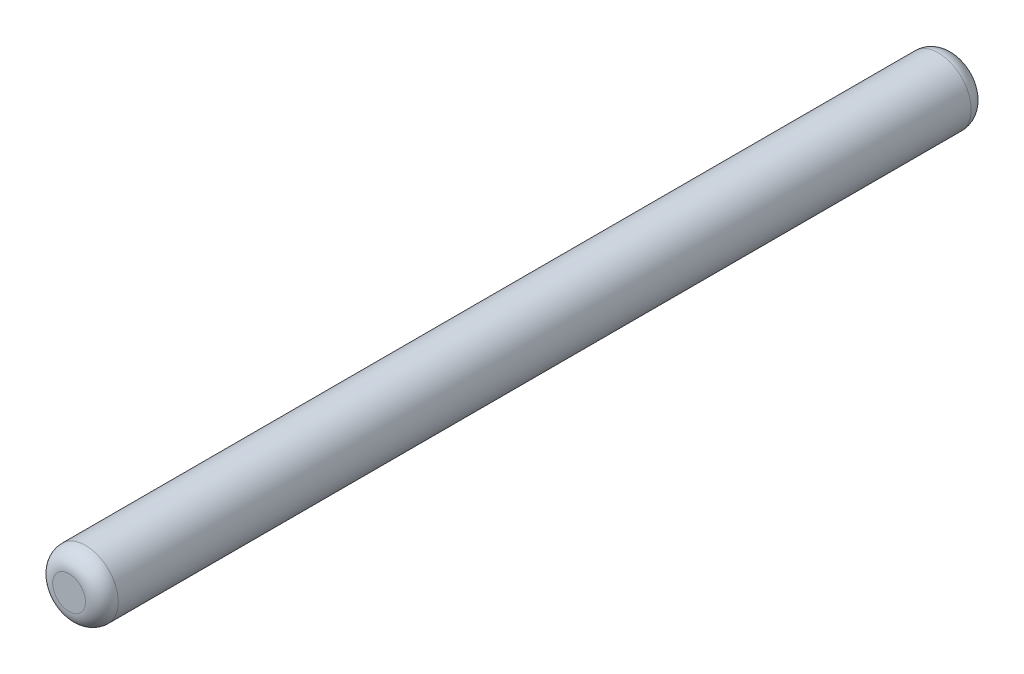
ISO-10303-21;
HEADER;
FILE_DESCRIPTION(('STEP AP214'),'2;1');
FILE_NAME('part.step','',(''),(''),'','','');
FILE_SCHEMA(('AUTOMOTIVE_DESIGN { 1 0 10303 214 1 1 1 1 }'));
ENDSEC;
DATA;
#1=APPLICATION_CONTEXT('core data for automotive mechanical design processes');
#2=APPLICATION_PROTOCOL_DEFINITION('international standard','automotive_design',2000,#1);
#3=PRODUCT_CONTEXT('',#1,'mechanical');
#4=PRODUCT('Part','Part','',(#3));
#5=PRODUCT_RELATED_PRODUCT_CATEGORY('part','',(#4));
#6=PRODUCT_DEFINITION_FORMATION('','',#4);
#7=PRODUCT_DEFINITION_CONTEXT('part definition',#1,'design');
#8=PRODUCT_DEFINITION('design','',#6,#7);
#9=PRODUCT_DEFINITION_SHAPE('','',#8);
#10=(LENGTH_UNIT() NAMED_UNIT(*) SI_UNIT(.MILLI.,.METRE.));
#11=(NAMED_UNIT(*) PLANE_ANGLE_UNIT() SI_UNIT($,.RADIAN.));
#12=(NAMED_UNIT(*) SI_UNIT($,.STERADIAN.) SOLID_ANGLE_UNIT());
#13=UNCERTAINTY_MEASURE_WITH_UNIT(LENGTH_MEASURE(1.E-05),#10,'distance_accuracy_value','');
#14=(GEOMETRIC_REPRESENTATION_CONTEXT(3) GLOBAL_UNCERTAINTY_ASSIGNED_CONTEXT((#13)) GLOBAL_UNIT_ASSIGNED_CONTEXT((#10,
#11,#12)) REPRESENTATION_CONTEXT('',''));
#15=CARTESIAN_POINT('',(0.,0.,0.));
#16=DIRECTION('',(0.,0.,1.));
#17=DIRECTION('',(1.,0.,0.));
#18=AXIS2_PLACEMENT_3D('',#15,#16,#17);
#19=CARTESIAN_POINT('',(0.,0.,27.));
#20=DIRECTION('',(0.,0.,-1.));
#21=DIRECTION('',(-1.,0.,0.));
#22=AXIS2_PLACEMENT_3D('',#19,#20,#21);
#23=CYLINDRICAL_SURFACE('',#22,2.);
#24=CARTESIAN_POINT('',(0.,0.,-26.));
#25=DIRECTION('',(0.,0.,1.));
#26=DIRECTION('',(1.,0.,0.));
#27=AXIS2_PLACEMENT_3D('',#24,#25,#26);
#28=CIRCLE('',#27,2.);
#29=CARTESIAN_POINT('',(2.,0.,-26.));
#30=VERTEX_POINT('',#29);
#31=EDGE_CURVE('E48',#30,#30,#28,.T.);
#32=ORIENTED_EDGE('',*,*,#31,.T.);
#33=EDGE_LOOP('',(#32));
#34=FACE_BOUND('',#33,.T.);
#35=CARTESIAN_POINT('',(0.,0.,26.));
#36=DIRECTION('',(0.,0.,1.));
#37=DIRECTION('',(1.,0.,0.));
#38=AXIS2_PLACEMENT_3D('',#35,#36,#37);
#39=CIRCLE('',#38,2.);
#40=CARTESIAN_POINT('',(2.,0.,26.));
#41=VERTEX_POINT('',#40);
#42=EDGE_CURVE('E52',#41,#41,#39,.F.);
#43=ORIENTED_EDGE('',*,*,#42,.T.);
#44=EDGE_LOOP('',(#43));
#45=FACE_BOUND('',#44,.T.);
#46=ADVANCED_FACE('F41',(#34,#45),#23,.T.);
#47=CARTESIAN_POINT('',(0.,0.,27.));
#48=DIRECTION('',(0.,0.,1.));
#49=DIRECTION('',(1.,0.,0.));
#50=AXIS2_PLACEMENT_3D('',#47,#48,#49);
#51=PLANE('',#50);
#52=CARTESIAN_POINT('',(0.,0.,27.));
#53=DIRECTION('',(0.,0.,1.));
#54=DIRECTION('',(1.,0.,0.));
#55=AXIS2_PLACEMENT_3D('',#52,#53,#54);
#56=CIRCLE('',#55,1.);
#57=CARTESIAN_POINT('',(1.,0.,27.));
#58=VERTEX_POINT('',#57);
#59=EDGE_CURVE('E56',#58,#58,#56,.T.);
#60=ORIENTED_EDGE('',*,*,#59,.T.);
#61=EDGE_LOOP('',(#60));
#62=FACE_BOUND('',#61,.T.);
#63=ADVANCED_FACE('F62',(#62),#51,.T.);
#64=CARTESIAN_POINT('',(0.,0.,-27.));
#65=DIRECTION('',(0.,0.,1.));
#66=DIRECTION('',(1.,0.,0.));
#67=AXIS2_PLACEMENT_3D('',#64,#65,#66);
#68=PLANE('',#67);
#69=CARTESIAN_POINT('',(0.,0.,-27.));
#70=DIRECTION('',(0.,0.,1.));
#71=DIRECTION('',(1.,0.,0.));
#72=AXIS2_PLACEMENT_3D('',#69,#70,#71);
#73=CIRCLE('',#72,1.);
#74=CARTESIAN_POINT('',(1.,0.,-27.));
#75=VERTEX_POINT('',#74);
#76=EDGE_CURVE('E10',#75,#75,#73,.F.);
#77=ORIENTED_EDGE('',*,*,#76,.T.);
#78=EDGE_LOOP('',(#77));
#79=FACE_BOUND('',#78,.T.);
#80=ADVANCED_FACE('F66',(#79),#68,.F.);
#81=CARTESIAN_POINT('',(0.,0.,26.));
#82=DIRECTION('',(0.,0.,1.));
#83=DIRECTION('',(1.,0.,0.));
#84=AXIS2_PLACEMENT_3D('',#81,#82,#83);
#85=DEGENERATE_TOROIDAL_SURFACE('',#84,1.,1.,.T.);
#86=ORIENTED_EDGE('',*,*,#42,.F.);
#87=EDGE_LOOP('',(#86));
#88=FACE_BOUND('',#87,.T.);
#89=ORIENTED_EDGE('',*,*,#59,.F.);
#90=EDGE_LOOP('',(#89));
#91=FACE_BOUND('',#90,.T.);
#92=ADVANCED_FACE('F64',(#88,#91),#85,.T.);
#93=CARTESIAN_POINT('',(0.,0.,-26.));
#94=DIRECTION('',(0.,0.,1.));
#95=DIRECTION('',(1.,0.,0.));
#96=AXIS2_PLACEMENT_3D('',#93,#94,#95);
#97=DEGENERATE_TOROIDAL_SURFACE('',#96,1.,1.,.T.);
#98=ORIENTED_EDGE('',*,*,#76,.F.);
#99=EDGE_LOOP('',(#98));
#100=FACE_BOUND('',#99,.T.);
#101=ORIENTED_EDGE('',*,*,#31,.F.);
#102=EDGE_LOOP('',(#101));
#103=FACE_BOUND('',#102,.T.);
#104=ADVANCED_FACE('F43',(#100,#103),#97,.T.);
#105=CLOSED_SHELL('',(#46,#63,#80,#92,#104));
#106=MANIFOLD_SOLID_BREP('B2',#105);
#107=ADVANCED_BREP_SHAPE_REPRESENTATION('',(#18,#106),#14);
#108=SHAPE_DEFINITION_REPRESENTATION(#9,#107);
ENDSEC;
END-ISO-10303-21;
